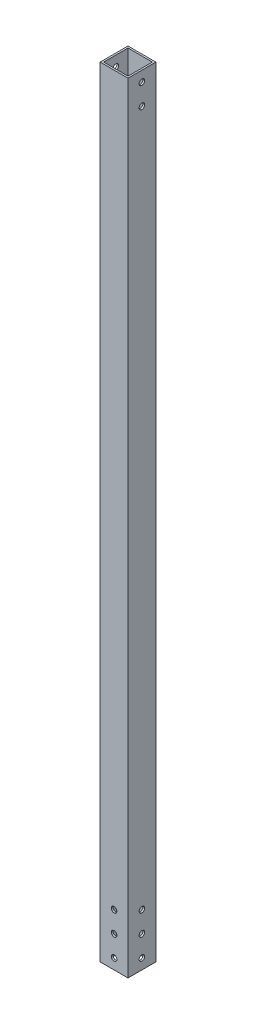
ISO-10303-21;
HEADER;
FILE_DESCRIPTION(('STEP AP214'),'2;1');
FILE_NAME('part.step','',(''),(''),'','','');
FILE_SCHEMA(('AUTOMOTIVE_DESIGN { 1 0 10303 214 1 1 1 1 }'));
ENDSEC;
DATA;
#1=APPLICATION_CONTEXT('core data for automotive mechanical design processes');
#2=APPLICATION_PROTOCOL_DEFINITION('international standard','automotive_design',2000,#1);
#3=PRODUCT_CONTEXT('',#1,'mechanical');
#4=PRODUCT('Part','Part','',(#3));
#5=PRODUCT_RELATED_PRODUCT_CATEGORY('part','',(#4));
#6=PRODUCT_DEFINITION_FORMATION('','',#4);
#7=PRODUCT_DEFINITION_CONTEXT('part definition',#1,'design');
#8=PRODUCT_DEFINITION('design','',#6,#7);
#9=PRODUCT_DEFINITION_SHAPE('','',#8);
#10=(LENGTH_UNIT() NAMED_UNIT(*) SI_UNIT(.MILLI.,.METRE.));
#11=(NAMED_UNIT(*) PLANE_ANGLE_UNIT() SI_UNIT($,.RADIAN.));
#12=(NAMED_UNIT(*) SI_UNIT($,.STERADIAN.) SOLID_ANGLE_UNIT());
#13=UNCERTAINTY_MEASURE_WITH_UNIT(LENGTH_MEASURE(1.E-05),#10,'distance_accuracy_value','');
#14=(GEOMETRIC_REPRESENTATION_CONTEXT(3) GLOBAL_UNCERTAINTY_ASSIGNED_CONTEXT((#13)) GLOBAL_UNIT_ASSIGNED_CONTEXT((#10,
#11,#12)) REPRESENTATION_CONTEXT('',''));
#15=CARTESIAN_POINT('',(0.,0.,0.));
#16=DIRECTION('',(0.,0.,1.));
#17=DIRECTION('',(1.,0.,0.));
#18=AXIS2_PLACEMENT_3D('',#15,#16,#17);
#19=CARTESIAN_POINT('',(0.,711.2,0.));
#20=DIRECTION('',(0.,1.,0.));
#21=DIRECTION('',(0.,0.,1.));
#22=AXIS2_PLACEMENT_3D('',#19,#20,#21);
#23=PLANE('',#22);
#24=DIRECTION('',(0.,0.,1.));
#25=VECTOR('',#24,1.);
#26=CARTESIAN_POINT('',(-12.7,711.2,12.7));
#27=LINE('',#26,#25);
#28=CARTESIAN_POINT('',(-12.7,711.2,-12.7));
#29=VERTEX_POINT('',#28);
#30=CARTESIAN_POINT('',(-12.7,711.2,12.7));
#31=VERTEX_POINT('',#30);
#32=EDGE_CURVE('E149',#29,#31,#27,.T.);
#33=ORIENTED_EDGE('',*,*,#32,.T.);
#34=DIRECTION('',(1.,0.,0.));
#35=VECTOR('',#34,1.);
#36=CARTESIAN_POINT('',(12.7,711.2,12.7));
#37=LINE('',#36,#35);
#38=CARTESIAN_POINT('',(12.7,711.2,12.7));
#39=VERTEX_POINT('',#38);
#40=EDGE_CURVE('E152',#31,#39,#37,.T.);
#41=ORIENTED_EDGE('',*,*,#40,.T.);
#42=DIRECTION('',(0.,0.,-1.));
#43=VECTOR('',#42,1.);
#44=CARTESIAN_POINT('',(12.7,711.2,12.7));
#45=LINE('',#44,#43);
#46=CARTESIAN_POINT('',(12.7,711.2,-12.7));
#47=VERTEX_POINT('',#46);
#48=EDGE_CURVE('E155',#39,#47,#45,.T.);
#49=ORIENTED_EDGE('',*,*,#48,.T.);
#50=DIRECTION('',(-1.,0.,0.));
#51=VECTOR('',#50,1.);
#52=CARTESIAN_POINT('',(12.7,711.2,-12.7));
#53=LINE('',#52,#51);
#54=EDGE_CURVE('E157',#47,#29,#53,.T.);
#55=ORIENTED_EDGE('',*,*,#54,.T.);
#56=EDGE_LOOP('',(#33,#41,#49,#55));
#57=FACE_BOUND('',#56,.T.);
#58=DIRECTION('',(-1.,0.,0.));
#59=VECTOR('',#58,1.);
#60=CARTESIAN_POINT('',(11.1125,711.2,-11.1125));
#61=LINE('',#60,#59);
#62=CARTESIAN_POINT('',(11.1125,711.2,-11.1125));
#63=VERTEX_POINT('',#62);
#64=CARTESIAN_POINT('',(-11.1125,711.2,-11.1125));
#65=VERTEX_POINT('',#64);
#66=EDGE_CURVE('E115',#63,#65,#61,.T.);
#67=ORIENTED_EDGE('',*,*,#66,.F.);
#68=DIRECTION('',(0.,0.,-1.));
#69=VECTOR('',#68,1.);
#70=CARTESIAN_POINT('',(11.1125,711.2,11.1125));
#71=LINE('',#70,#69);
#72=CARTESIAN_POINT('',(11.1125,711.2,11.1125));
#73=VERTEX_POINT('',#72);
#74=EDGE_CURVE('E107',#73,#63,#71,.T.);
#75=ORIENTED_EDGE('',*,*,#74,.F.);
#76=DIRECTION('',(1.,0.,0.));
#77=VECTOR('',#76,1.);
#78=CARTESIAN_POINT('',(11.1125,711.2,11.1125));
#79=LINE('',#78,#77);
#80=CARTESIAN_POINT('',(-11.1125,711.2,11.1125));
#81=VERTEX_POINT('',#80);
#82=EDGE_CURVE('E130',#81,#73,#79,.T.);
#83=ORIENTED_EDGE('',*,*,#82,.F.);
#84=DIRECTION('',(0.,0.,1.));
#85=VECTOR('',#84,1.);
#86=CARTESIAN_POINT('',(-11.1125,711.2,11.1125));
#87=LINE('',#86,#85);
#88=EDGE_CURVE('E128',#65,#81,#87,.T.);
#89=ORIENTED_EDGE('',*,*,#88,.F.);
#90=EDGE_LOOP('',(#67,#75,#83,#89));
#91=FACE_BOUND('',#90,.T.);
#92=ADVANCED_FACE('F39',(#57,#91),#23,.T.);
#93=CARTESIAN_POINT('',(0.,0.,0.));
#94=DIRECTION('',(0.,1.,0.));
#95=DIRECTION('',(0.,0.,1.));
#96=AXIS2_PLACEMENT_3D('',#93,#94,#95);
#97=PLANE('',#96);
#98=DIRECTION('',(0.,0.,1.));
#99=VECTOR('',#98,1.);
#100=CARTESIAN_POINT('',(-12.7,0.,12.7));
#101=LINE('',#100,#99);
#102=CARTESIAN_POINT('',(-12.7,0.,-12.7));
#103=VERTEX_POINT('',#102);
#104=CARTESIAN_POINT('',(-12.7,0.,12.7));
#105=VERTEX_POINT('',#104);
#106=EDGE_CURVE('E124',#103,#105,#101,.T.);
#107=ORIENTED_EDGE('',*,*,#106,.F.);
#108=DIRECTION('',(-1.,0.,0.));
#109=VECTOR('',#108,1.);
#110=CARTESIAN_POINT('',(12.7,0.,-12.7));
#111=LINE('',#110,#109);
#112=CARTESIAN_POINT('',(12.7,0.,-12.7));
#113=VERTEX_POINT('',#112);
#114=EDGE_CURVE('E153',#113,#103,#111,.T.);
#115=ORIENTED_EDGE('',*,*,#114,.F.);
#116=DIRECTION('',(0.,0.,-1.));
#117=VECTOR('',#116,1.);
#118=CARTESIAN_POINT('',(12.7,0.,12.7));
#119=LINE('',#118,#117);
#120=CARTESIAN_POINT('',(12.7,0.,12.7));
#121=VERTEX_POINT('',#120);
#122=EDGE_CURVE('E164',#121,#113,#119,.T.);
#123=ORIENTED_EDGE('',*,*,#122,.F.);
#124=DIRECTION('',(1.,0.,0.));
#125=VECTOR('',#124,1.);
#126=CARTESIAN_POINT('',(12.7,0.,12.7));
#127=LINE('',#126,#125);
#128=EDGE_CURVE('E162',#105,#121,#127,.T.);
#129=ORIENTED_EDGE('',*,*,#128,.F.);
#130=EDGE_LOOP('',(#107,#115,#123,#129));
#131=FACE_BOUND('',#130,.T.);
#132=DIRECTION('',(0.,0.,-1.));
#133=VECTOR('',#132,1.);
#134=CARTESIAN_POINT('',(11.1125,0.,11.1125));
#135=LINE('',#134,#133);
#136=CARTESIAN_POINT('',(11.1125,0.,11.1125));
#137=VERTEX_POINT('',#136);
#138=CARTESIAN_POINT('',(11.1125,0.,-11.1125));
#139=VERTEX_POINT('',#138);
#140=EDGE_CURVE('E65',#137,#139,#135,.T.);
#141=ORIENTED_EDGE('',*,*,#140,.T.);
#142=DIRECTION('',(-1.,0.,0.));
#143=VECTOR('',#142,1.);
#144=CARTESIAN_POINT('',(11.1125,0.,-11.1125));
#145=LINE('',#144,#143);
#146=CARTESIAN_POINT('',(-11.1125,0.,-11.1125));
#147=VERTEX_POINT('',#146);
#148=EDGE_CURVE('E122',#139,#147,#145,.T.);
#149=ORIENTED_EDGE('',*,*,#148,.T.);
#150=DIRECTION('',(0.,0.,1.));
#151=VECTOR('',#150,1.);
#152=CARTESIAN_POINT('',(-11.1125,0.,11.1125));
#153=LINE('',#152,#151);
#154=CARTESIAN_POINT('',(-11.1125,0.,11.1125));
#155=VERTEX_POINT('',#154);
#156=EDGE_CURVE('E138',#147,#155,#153,.T.);
#157=ORIENTED_EDGE('',*,*,#156,.T.);
#158=DIRECTION('',(1.,0.,0.));
#159=VECTOR('',#158,1.);
#160=CARTESIAN_POINT('',(11.1125,0.,11.1125));
#161=LINE('',#160,#159);
#162=EDGE_CURVE('E116',#155,#137,#161,.T.);
#163=ORIENTED_EDGE('',*,*,#162,.T.);
#164=EDGE_LOOP('',(#141,#149,#157,#163));
#165=FACE_BOUND('',#164,.T.);
#166=ADVANCED_FACE('F277',(#131,#165),#97,.F.);
#167=CARTESIAN_POINT('',(-12.7,711.2,12.7));
#168=DIRECTION('',(1.,0.,0.));
#169=DIRECTION('',(0.,0.,-1.));
#170=AXIS2_PLACEMENT_3D('',#167,#168,#169);
#171=PLANE('',#170);
#172=CARTESIAN_POINT('',(-12.7,9.525,0.));
#173=DIRECTION('',(1.,0.,0.));
#174=DIRECTION('',(0.,0.,-1.));
#175=AXIS2_PLACEMENT_3D('',#172,#173,#174);
#176=CIRCLE('',#175,2.5527);
#177=CARTESIAN_POINT('',(-12.7,9.525,-2.5527));
#178=VERTEX_POINT('',#177);
#179=EDGE_CURVE('E193',#178,#178,#176,.T.);
#180=ORIENTED_EDGE('',*,*,#179,.T.);
#181=EDGE_LOOP('',(#180));
#182=FACE_BOUND('',#181,.T.);
#183=CARTESIAN_POINT('',(-12.7,28.575,0.));
#184=DIRECTION('',(1.,0.,0.));
#185=DIRECTION('',(0.,0.,-1.));
#186=AXIS2_PLACEMENT_3D('',#183,#184,#185);
#187=CIRCLE('',#186,2.5527);
#188=CARTESIAN_POINT('',(-12.7,28.575,-2.5527));
#189=VERTEX_POINT('',#188);
#190=EDGE_CURVE('E359',#189,#189,#187,.T.);
#191=ORIENTED_EDGE('',*,*,#190,.T.);
#192=EDGE_LOOP('',(#191));
#193=FACE_BOUND('',#192,.T.);
#194=CARTESIAN_POINT('',(-12.7,47.625,0.));
#195=DIRECTION('',(1.,0.,0.));
#196=DIRECTION('',(0.,0.,-1.));
#197=AXIS2_PLACEMENT_3D('',#194,#195,#196);
#198=CIRCLE('',#197,2.5527);
#199=CARTESIAN_POINT('',(-12.7,47.625,-2.5527));
#200=VERTEX_POINT('',#199);
#201=EDGE_CURVE('E369',#200,#200,#198,.T.);
#202=ORIENTED_EDGE('',*,*,#201,.T.);
#203=EDGE_LOOP('',(#202));
#204=FACE_BOUND('',#203,.T.);
#205=CARTESIAN_POINT('',(-12.7,701.675,0.));
#206=DIRECTION('',(1.,0.,0.));
#207=DIRECTION('',(0.,0.,-1.));
#208=AXIS2_PLACEMENT_3D('',#205,#206,#207);
#209=CIRCLE('',#208,2.55270000000006);
#210=CARTESIAN_POINT('',(-12.7,701.675,-2.55270000000006));
#211=VERTEX_POINT('',#210);
#212=EDGE_CURVE('E375',#211,#211,#209,.T.);
#213=ORIENTED_EDGE('',*,*,#212,.T.);
#214=EDGE_LOOP('',(#213));
#215=FACE_BOUND('',#214,.T.);
#216=CARTESIAN_POINT('',(-12.7,682.625,0.));
#217=DIRECTION('',(1.,0.,0.));
#218=DIRECTION('',(0.,0.,-1.));
#219=AXIS2_PLACEMENT_3D('',#216,#217,#218);
#220=CIRCLE('',#219,2.55270000000006);
#221=CARTESIAN_POINT('',(-12.7,682.625,-2.55270000000006));
#222=VERTEX_POINT('',#221);
#223=EDGE_CURVE('E381',#222,#222,#220,.T.);
#224=ORIENTED_EDGE('',*,*,#223,.T.);
#225=EDGE_LOOP('',(#224));
#226=FACE_BOUND('',#225,.T.);
#227=ORIENTED_EDGE('',*,*,#106,.T.);
#228=DIRECTION('',(0.,-1.,0.));
#229=VECTOR('',#228,1.);
#230=CARTESIAN_POINT('',(-12.7,711.2,12.7));
#231=LINE('',#230,#229);
#232=EDGE_CURVE('E11',#31,#105,#231,.T.);
#233=ORIENTED_EDGE('',*,*,#232,.F.);
#234=ORIENTED_EDGE('',*,*,#32,.F.);
#235=DIRECTION('',(0.,-1.,0.));
#236=VECTOR('',#235,1.);
#237=CARTESIAN_POINT('',(-12.7,711.2,-12.7));
#238=LINE('',#237,#236);
#239=EDGE_CURVE('E159',#29,#103,#238,.T.);
#240=ORIENTED_EDGE('',*,*,#239,.T.);
#241=EDGE_LOOP('',(#227,#233,#234,#240));
#242=FACE_BOUND('',#241,.T.);
#243=ADVANCED_FACE('F41',(#182,#193,#204,#215,#226,#242),#171,.F.);
#244=CARTESIAN_POINT('',(12.7,711.2,12.7));
#245=DIRECTION('',(0.,0.,-1.));
#246=DIRECTION('',(-1.,0.,0.));
#247=AXIS2_PLACEMENT_3D('',#244,#245,#246);
#248=PLANE('',#247);
#249=CARTESIAN_POINT('',(0.,9.525,12.7));
#250=DIRECTION('',(0.,0.,1.));
#251=DIRECTION('',(1.,0.,0.));
#252=AXIS2_PLACEMENT_3D('',#249,#250,#251);
#253=CIRCLE('',#252,2.5527);
#254=CARTESIAN_POINT('',(2.5527,9.525,12.7));
#255=VERTEX_POINT('',#254);
#256=EDGE_CURVE('E221',#255,#255,#253,.T.);
#257=ORIENTED_EDGE('',*,*,#256,.F.);
#258=EDGE_LOOP('',(#257));
#259=FACE_BOUND('',#258,.T.);
#260=CARTESIAN_POINT('',(0.,28.575,12.7));
#261=DIRECTION('',(0.,0.,1.));
#262=DIRECTION('',(1.,0.,0.));
#263=AXIS2_PLACEMENT_3D('',#260,#261,#262);
#264=CIRCLE('',#263,2.5527);
#265=CARTESIAN_POINT('',(2.5527,28.575,12.7));
#266=VERTEX_POINT('',#265);
#267=EDGE_CURVE('E227',#266,#266,#264,.T.);
#268=ORIENTED_EDGE('',*,*,#267,.F.);
#269=EDGE_LOOP('',(#268));
#270=FACE_BOUND('',#269,.T.);
#271=CARTESIAN_POINT('',(0.,47.625,12.7));
#272=DIRECTION('',(0.,0.,1.));
#273=DIRECTION('',(1.,0.,0.));
#274=AXIS2_PLACEMENT_3D('',#271,#272,#273);
#275=CIRCLE('',#274,2.5527);
#276=CARTESIAN_POINT('',(2.5527,47.625,12.7));
#277=VERTEX_POINT('',#276);
#278=EDGE_CURVE('E218',#277,#277,#275,.T.);
#279=ORIENTED_EDGE('',*,*,#278,.F.);
#280=EDGE_LOOP('',(#279));
#281=FACE_BOUND('',#280,.T.);
#282=ORIENTED_EDGE('',*,*,#128,.T.);
#283=DIRECTION('',(0.,-1.,0.));
#284=VECTOR('',#283,1.);
#285=CARTESIAN_POINT('',(12.7,711.2,12.7));
#286=LINE('',#285,#284);
#287=EDGE_CURVE('E49',#39,#121,#286,.T.);
#288=ORIENTED_EDGE('',*,*,#287,.F.);
#289=ORIENTED_EDGE('',*,*,#40,.F.);
#290=ORIENTED_EDGE('',*,*,#232,.T.);
#291=EDGE_LOOP('',(#282,#288,#289,#290));
#292=FACE_BOUND('',#291,.T.);
#293=ADVANCED_FACE('F281',(#259,#270,#281,#292),#248,.F.);
#294=CARTESIAN_POINT('',(12.7,711.2,12.7));
#295=DIRECTION('',(-1.,0.,0.));
#296=DIRECTION('',(0.,0.,1.));
#297=AXIS2_PLACEMENT_3D('',#294,#295,#296);
#298=PLANE('',#297);
#299=CARTESIAN_POINT('',(12.7,9.525,0.));
#300=DIRECTION('',(1.,0.,0.));
#301=DIRECTION('',(0.,0.,-1.));
#302=AXIS2_PLACEMENT_3D('',#299,#300,#301);
#303=CIRCLE('',#302,2.5527);
#304=CARTESIAN_POINT('',(12.7,9.525,-2.5527));
#305=VERTEX_POINT('',#304);
#306=EDGE_CURVE('E358',#305,#305,#303,.T.);
#307=ORIENTED_EDGE('',*,*,#306,.F.);
#308=EDGE_LOOP('',(#307));
#309=FACE_BOUND('',#308,.T.);
#310=CARTESIAN_POINT('',(12.7,28.575,0.));
#311=DIRECTION('',(1.,0.,0.));
#312=DIRECTION('',(0.,0.,-1.));
#313=AXIS2_PLACEMENT_3D('',#310,#311,#312);
#314=CIRCLE('',#313,2.5527);
#315=CARTESIAN_POINT('',(12.7,28.575,-2.5527));
#316=VERTEX_POINT('',#315);
#317=EDGE_CURVE('E364',#316,#316,#314,.T.);
#318=ORIENTED_EDGE('',*,*,#317,.F.);
#319=EDGE_LOOP('',(#318));
#320=FACE_BOUND('',#319,.T.);
#321=CARTESIAN_POINT('',(12.7,47.625,0.));
#322=DIRECTION('',(1.,0.,0.));
#323=DIRECTION('',(0.,0.,-1.));
#324=AXIS2_PLACEMENT_3D('',#321,#322,#323);
#325=CIRCLE('',#324,2.5527);
#326=CARTESIAN_POINT('',(12.7,47.625,-2.5527));
#327=VERTEX_POINT('',#326);
#328=EDGE_CURVE('E372',#327,#327,#325,.T.);
#329=ORIENTED_EDGE('',*,*,#328,.F.);
#330=EDGE_LOOP('',(#329));
#331=FACE_BOUND('',#330,.T.);
#332=CARTESIAN_POINT('',(12.7,701.675,0.));
#333=DIRECTION('',(1.,0.,0.));
#334=DIRECTION('',(0.,0.,-1.));
#335=AXIS2_PLACEMENT_3D('',#332,#333,#334);
#336=CIRCLE('',#335,2.55270000000006);
#337=CARTESIAN_POINT('',(12.7,701.675,-2.55270000000006));
#338=VERTEX_POINT('',#337);
#339=EDGE_CURVE('E378',#338,#338,#336,.T.);
#340=ORIENTED_EDGE('',*,*,#339,.F.);
#341=EDGE_LOOP('',(#340));
#342=FACE_BOUND('',#341,.T.);
#343=CARTESIAN_POINT('',(12.7,682.625,0.));
#344=DIRECTION('',(1.,0.,0.));
#345=DIRECTION('',(0.,0.,-1.));
#346=AXIS2_PLACEMENT_3D('',#343,#344,#345);
#347=CIRCLE('',#346,2.55270000000006);
#348=CARTESIAN_POINT('',(12.7,682.625,-2.55270000000006));
#349=VERTEX_POINT('',#348);
#350=EDGE_CURVE('E384',#349,#349,#347,.T.);
#351=ORIENTED_EDGE('',*,*,#350,.F.);
#352=EDGE_LOOP('',(#351));
#353=FACE_BOUND('',#352,.T.);
#354=ORIENTED_EDGE('',*,*,#122,.T.);
#355=DIRECTION('',(0.,-1.,0.));
#356=VECTOR('',#355,1.);
#357=CARTESIAN_POINT('',(12.7,711.2,-12.7));
#358=LINE('',#357,#356);
#359=EDGE_CURVE('E170',#47,#113,#358,.T.);
#360=ORIENTED_EDGE('',*,*,#359,.F.);
#361=ORIENTED_EDGE('',*,*,#48,.F.);
#362=ORIENTED_EDGE('',*,*,#287,.T.);
#363=EDGE_LOOP('',(#354,#360,#361,#362));
#364=FACE_BOUND('',#363,.T.);
#365=ADVANCED_FACE('F264',(#309,#320,#331,#342,#353,#364),#298,.F.);
#366=CARTESIAN_POINT('',(12.7,711.2,-12.7));
#367=DIRECTION('',(0.,0.,1.));
#368=DIRECTION('',(1.,0.,0.));
#369=AXIS2_PLACEMENT_3D('',#366,#367,#368);
#370=PLANE('',#369);
#371=CARTESIAN_POINT('',(0.,9.525,-12.7));
#372=DIRECTION('',(0.,0.,1.));
#373=DIRECTION('',(1.,0.,0.));
#374=AXIS2_PLACEMENT_3D('',#371,#372,#373);
#375=CIRCLE('',#374,2.5527);
#376=CARTESIAN_POINT('',(2.5527,9.525,-12.7));
#377=VERTEX_POINT('',#376);
#378=EDGE_CURVE('E181',#377,#377,#375,.T.);
#379=ORIENTED_EDGE('',*,*,#378,.T.);
#380=EDGE_LOOP('',(#379));
#381=FACE_BOUND('',#380,.T.);
#382=CARTESIAN_POINT('',(0.,28.575,-12.7));
#383=DIRECTION('',(0.,0.,1.));
#384=DIRECTION('',(1.,0.,0.));
#385=AXIS2_PLACEMENT_3D('',#382,#383,#384);
#386=CIRCLE('',#385,2.5527);
#387=CARTESIAN_POINT('',(2.5527,28.575,-12.7));
#388=VERTEX_POINT('',#387);
#389=EDGE_CURVE('E224',#388,#388,#386,.T.);
#390=ORIENTED_EDGE('',*,*,#389,.T.);
#391=EDGE_LOOP('',(#390));
#392=FACE_BOUND('',#391,.T.);
#393=CARTESIAN_POINT('',(0.,47.625,-12.7));
#394=DIRECTION('',(0.,0.,1.));
#395=DIRECTION('',(1.,0.,0.));
#396=AXIS2_PLACEMENT_3D('',#393,#394,#395);
#397=CIRCLE('',#396,2.5527);
#398=CARTESIAN_POINT('',(2.5527,47.625,-12.7));
#399=VERTEX_POINT('',#398);
#400=EDGE_CURVE('E230',#399,#399,#397,.T.);
#401=ORIENTED_EDGE('',*,*,#400,.T.);
#402=EDGE_LOOP('',(#401));
#403=FACE_BOUND('',#402,.T.);
#404=ORIENTED_EDGE('',*,*,#114,.T.);
#405=ORIENTED_EDGE('',*,*,#239,.F.);
#406=ORIENTED_EDGE('',*,*,#54,.F.);
#407=ORIENTED_EDGE('',*,*,#359,.T.);
#408=EDGE_LOOP('',(#404,#405,#406,#407));
#409=FACE_BOUND('',#408,.T.);
#410=ADVANCED_FACE('F261',(#381,#392,#403,#409),#370,.F.);
#411=CARTESIAN_POINT('',(11.1125,711.2,11.1125));
#412=DIRECTION('',(-1.,0.,0.));
#413=DIRECTION('',(0.,0.,1.));
#414=AXIS2_PLACEMENT_3D('',#411,#412,#413);
#415=PLANE('',#414);
#416=CARTESIAN_POINT('',(11.1125,9.525,0.));
#417=DIRECTION('',(-1.,0.,0.));
#418=DIRECTION('',(0.,0.,1.));
#419=AXIS2_PLACEMENT_3D('',#416,#417,#418);
#420=CIRCLE('',#419,2.5527);
#421=CARTESIAN_POINT('',(11.1125,9.525,2.5527));
#422=VERTEX_POINT('',#421);
#423=EDGE_CURVE('E215',#422,#422,#420,.T.);
#424=ORIENTED_EDGE('',*,*,#423,.F.);
#425=EDGE_LOOP('',(#424));
#426=FACE_BOUND('',#425,.T.);
#427=CARTESIAN_POINT('',(11.1125,28.575,0.));
#428=DIRECTION('',(-1.,0.,0.));
#429=DIRECTION('',(0.,0.,1.));
#430=AXIS2_PLACEMENT_3D('',#427,#428,#429);
#431=CIRCLE('',#430,2.5527);
#432=CARTESIAN_POINT('',(11.1125,28.575,2.5527));
#433=VERTEX_POINT('',#432);
#434=EDGE_CURVE('E203',#433,#433,#431,.T.);
#435=ORIENTED_EDGE('',*,*,#434,.F.);
#436=EDGE_LOOP('',(#435));
#437=FACE_BOUND('',#436,.T.);
#438=CARTESIAN_POINT('',(11.1125,47.625,0.));
#439=DIRECTION('',(-1.,0.,0.));
#440=DIRECTION('',(0.,0.,1.));
#441=AXIS2_PLACEMENT_3D('',#438,#439,#440);
#442=CIRCLE('',#441,2.5527);
#443=CARTESIAN_POINT('',(11.1125,47.625,2.5527));
#444=VERTEX_POINT('',#443);
#445=EDGE_CURVE('E200',#444,#444,#442,.T.);
#446=ORIENTED_EDGE('',*,*,#445,.F.);
#447=EDGE_LOOP('',(#446));
#448=FACE_BOUND('',#447,.T.);
#449=CARTESIAN_POINT('',(11.1125,701.675,0.));
#450=DIRECTION('',(-1.,0.,0.));
#451=DIRECTION('',(0.,0.,1.));
#452=AXIS2_PLACEMENT_3D('',#449,#450,#451);
#453=CIRCLE('',#452,2.55270000000006);
#454=CARTESIAN_POINT('',(11.1125,701.675,2.55270000000006));
#455=VERTEX_POINT('',#454);
#456=EDGE_CURVE('E197',#455,#455,#453,.T.);
#457=ORIENTED_EDGE('',*,*,#456,.F.);
#458=EDGE_LOOP('',(#457));
#459=FACE_BOUND('',#458,.T.);
#460=CARTESIAN_POINT('',(11.1125,682.625,0.));
#461=DIRECTION('',(-1.,0.,0.));
#462=DIRECTION('',(0.,0.,1.));
#463=AXIS2_PLACEMENT_3D('',#460,#461,#462);
#464=CIRCLE('',#463,2.55270000000006);
#465=CARTESIAN_POINT('',(11.1125,682.625,2.55270000000006));
#466=VERTEX_POINT('',#465);
#467=EDGE_CURVE('E192',#466,#466,#464,.T.);
#468=ORIENTED_EDGE('',*,*,#467,.F.);
#469=EDGE_LOOP('',(#468));
#470=FACE_BOUND('',#469,.T.);
#471=ORIENTED_EDGE('',*,*,#140,.F.);
#472=DIRECTION('',(0.,-1.,0.));
#473=VECTOR('',#472,1.);
#474=CARTESIAN_POINT('',(11.1125,711.2,11.1125));
#475=LINE('',#474,#473);
#476=EDGE_CURVE('E111',#73,#137,#475,.T.);
#477=ORIENTED_EDGE('',*,*,#476,.F.);
#478=ORIENTED_EDGE('',*,*,#74,.T.);
#479=DIRECTION('',(0.,-1.,0.));
#480=VECTOR('',#479,1.);
#481=CARTESIAN_POINT('',(11.1125,711.2,-11.1125));
#482=LINE('',#481,#480);
#483=EDGE_CURVE('E110',#63,#139,#482,.T.);
#484=ORIENTED_EDGE('',*,*,#483,.T.);
#485=EDGE_LOOP('',(#471,#477,#478,#484));
#486=FACE_BOUND('',#485,.T.);
#487=ADVANCED_FACE('F109',(#426,#437,#448,#459,#470,#486),#415,.T.);
#488=CARTESIAN_POINT('',(11.1125,711.2,-11.1125));
#489=DIRECTION('',(0.,0.,1.));
#490=DIRECTION('',(1.,0.,0.));
#491=AXIS2_PLACEMENT_3D('',#488,#489,#490);
#492=PLANE('',#491);
#493=CARTESIAN_POINT('',(0.,9.525,-11.1125));
#494=DIRECTION('',(0.,0.,1.));
#495=DIRECTION('',(1.,0.,0.));
#496=AXIS2_PLACEMENT_3D('',#493,#494,#495);
#497=CIRCLE('',#496,2.5527);
#498=CARTESIAN_POINT('',(2.5527,9.525,-11.1125));
#499=VERTEX_POINT('',#498);
#500=EDGE_CURVE('E136',#499,#499,#497,.T.);
#501=ORIENTED_EDGE('',*,*,#500,.F.);
#502=EDGE_LOOP('',(#501));
#503=FACE_BOUND('',#502,.T.);
#504=CARTESIAN_POINT('',(0.,28.575,-11.1125));
#505=DIRECTION('',(0.,0.,1.));
#506=DIRECTION('',(1.,0.,0.));
#507=AXIS2_PLACEMENT_3D('',#504,#505,#506);
#508=CIRCLE('',#507,2.5527);
#509=CARTESIAN_POINT('',(2.5527,28.575,-11.1125));
#510=VERTEX_POINT('',#509);
#511=EDGE_CURVE('E185',#510,#510,#508,.T.);
#512=ORIENTED_EDGE('',*,*,#511,.F.);
#513=EDGE_LOOP('',(#512));
#514=FACE_BOUND('',#513,.T.);
#515=CARTESIAN_POINT('',(0.,47.625,-11.1125));
#516=DIRECTION('',(0.,0.,1.));
#517=DIRECTION('',(1.,0.,0.));
#518=AXIS2_PLACEMENT_3D('',#515,#516,#517);
#519=CIRCLE('',#518,2.5527);
#520=CARTESIAN_POINT('',(2.5527,47.625,-11.1125));
#521=VERTEX_POINT('',#520);
#522=EDGE_CURVE('E180',#521,#521,#519,.T.);
#523=ORIENTED_EDGE('',*,*,#522,.F.);
#524=EDGE_LOOP('',(#523));
#525=FACE_BOUND('',#524,.T.);
#526=ORIENTED_EDGE('',*,*,#148,.F.);
#527=ORIENTED_EDGE('',*,*,#483,.F.);
#528=ORIENTED_EDGE('',*,*,#66,.T.);
#529=DIRECTION('',(0.,-1.,0.));
#530=VECTOR('',#529,1.);
#531=CARTESIAN_POINT('',(-11.1125,711.2,-11.1125));
#532=LINE('',#531,#530);
#533=EDGE_CURVE('E125',#65,#147,#532,.T.);
#534=ORIENTED_EDGE('',*,*,#533,.T.);
#535=EDGE_LOOP('',(#526,#527,#528,#534));
#536=FACE_BOUND('',#535,.T.);
#537=ADVANCED_FACE('F119',(#503,#514,#525,#536),#492,.T.);
#538=CARTESIAN_POINT('',(-11.1125,711.2,11.1125));
#539=DIRECTION('',(1.,0.,0.));
#540=DIRECTION('',(0.,0.,-1.));
#541=AXIS2_PLACEMENT_3D('',#538,#539,#540);
#542=PLANE('',#541);
#543=CARTESIAN_POINT('',(-11.1125,9.525,0.));
#544=DIRECTION('',(1.,0.,0.));
#545=DIRECTION('',(0.,0.,-1.));
#546=AXIS2_PLACEMENT_3D('',#543,#544,#545);
#547=CIRCLE('',#546,2.5527);
#548=CARTESIAN_POINT('',(-11.1125,9.525,-2.5527));
#549=VERTEX_POINT('',#548);
#550=EDGE_CURVE('E43',#549,#549,#547,.T.);
#551=ORIENTED_EDGE('',*,*,#550,.F.);
#552=EDGE_LOOP('',(#551));
#553=FACE_BOUND('',#552,.T.);
#554=CARTESIAN_POINT('',(-11.1125,28.575,0.));
#555=DIRECTION('',(1.,0.,0.));
#556=DIRECTION('',(0.,0.,-1.));
#557=AXIS2_PLACEMENT_3D('',#554,#555,#556);
#558=CIRCLE('',#557,2.5527);
#559=CARTESIAN_POINT('',(-11.1125,28.575,-2.5527));
#560=VERTEX_POINT('',#559);
#561=EDGE_CURVE('E201',#560,#560,#558,.T.);
#562=ORIENTED_EDGE('',*,*,#561,.F.);
#563=EDGE_LOOP('',(#562));
#564=FACE_BOUND('',#563,.T.);
#565=CARTESIAN_POINT('',(-11.1125,47.625,0.));
#566=DIRECTION('',(1.,0.,0.));
#567=DIRECTION('',(0.,0.,-1.));
#568=AXIS2_PLACEMENT_3D('',#565,#566,#567);
#569=CIRCLE('',#568,2.5527);
#570=CARTESIAN_POINT('',(-11.1125,47.625,-2.5527));
#571=VERTEX_POINT('',#570);
#572=EDGE_CURVE('E198',#571,#571,#569,.T.);
#573=ORIENTED_EDGE('',*,*,#572,.F.);
#574=EDGE_LOOP('',(#573));
#575=FACE_BOUND('',#574,.T.);
#576=CARTESIAN_POINT('',(-11.1125,701.675,0.));
#577=DIRECTION('',(1.,0.,0.));
#578=DIRECTION('',(0.,0.,-1.));
#579=AXIS2_PLACEMENT_3D('',#576,#577,#578);
#580=CIRCLE('',#579,2.55270000000006);
#581=CARTESIAN_POINT('',(-11.1125,701.675,-2.55270000000006));
#582=VERTEX_POINT('',#581);
#583=EDGE_CURVE('E194',#582,#582,#580,.T.);
#584=ORIENTED_EDGE('',*,*,#583,.F.);
#585=EDGE_LOOP('',(#584));
#586=FACE_BOUND('',#585,.T.);
#587=CARTESIAN_POINT('',(-11.1125,682.625,0.));
#588=DIRECTION('',(1.,0.,0.));
#589=DIRECTION('',(0.,0.,-1.));
#590=AXIS2_PLACEMENT_3D('',#587,#588,#589);
#591=CIRCLE('',#590,2.55270000000006);
#592=CARTESIAN_POINT('',(-11.1125,682.625,-2.55270000000006));
#593=VERTEX_POINT('',#592);
#594=EDGE_CURVE('E189',#593,#593,#591,.T.);
#595=ORIENTED_EDGE('',*,*,#594,.F.);
#596=EDGE_LOOP('',(#595));
#597=FACE_BOUND('',#596,.T.);
#598=ORIENTED_EDGE('',*,*,#156,.F.);
#599=ORIENTED_EDGE('',*,*,#533,.F.);
#600=ORIENTED_EDGE('',*,*,#88,.T.);
#601=DIRECTION('',(0.,-1.,0.));
#602=VECTOR('',#601,1.);
#603=CARTESIAN_POINT('',(-11.1125,711.2,11.1125));
#604=LINE('',#603,#602);
#605=EDGE_CURVE('E57',#81,#155,#604,.T.);
#606=ORIENTED_EDGE('',*,*,#605,.T.);
#607=EDGE_LOOP('',(#598,#599,#600,#606));
#608=FACE_BOUND('',#607,.T.);
#609=ADVANCED_FACE('F246',(#553,#564,#575,#586,#597,#608),#542,.T.);
#610=CARTESIAN_POINT('',(11.1125,711.2,11.1125));
#611=DIRECTION('',(0.,0.,-1.));
#612=DIRECTION('',(-1.,0.,0.));
#613=AXIS2_PLACEMENT_3D('',#610,#611,#612);
#614=PLANE('',#613);
#615=CARTESIAN_POINT('',(0.,9.525,11.1125));
#616=DIRECTION('',(0.,0.,-1.));
#617=DIRECTION('',(-1.,0.,0.));
#618=AXIS2_PLACEMENT_3D('',#615,#616,#617);
#619=CIRCLE('',#618,2.5527);
#620=CARTESIAN_POINT('',(-2.5527,9.525,11.1125));
#621=VERTEX_POINT('',#620);
#622=EDGE_CURVE('E186',#621,#621,#619,.T.);
#623=ORIENTED_EDGE('',*,*,#622,.F.);
#624=EDGE_LOOP('',(#623));
#625=FACE_BOUND('',#624,.T.);
#626=CARTESIAN_POINT('',(0.,28.575,11.1125));
#627=DIRECTION('',(0.,0.,-1.));
#628=DIRECTION('',(-1.,0.,0.));
#629=AXIS2_PLACEMENT_3D('',#626,#627,#628);
#630=CIRCLE('',#629,2.5527);
#631=CARTESIAN_POINT('',(-2.5527,28.575,11.1125));
#632=VERTEX_POINT('',#631);
#633=EDGE_CURVE('E182',#632,#632,#630,.T.);
#634=ORIENTED_EDGE('',*,*,#633,.F.);
#635=EDGE_LOOP('',(#634));
#636=FACE_BOUND('',#635,.T.);
#637=CARTESIAN_POINT('',(0.,47.625,11.1125));
#638=DIRECTION('',(0.,0.,-1.));
#639=DIRECTION('',(-1.,0.,0.));
#640=AXIS2_PLACEMENT_3D('',#637,#638,#639);
#641=CIRCLE('',#640,2.5527);
#642=CARTESIAN_POINT('',(-2.5527,47.625,11.1125));
#643=VERTEX_POINT('',#642);
#644=EDGE_CURVE('E177',#643,#643,#641,.T.);
#645=ORIENTED_EDGE('',*,*,#644,.F.);
#646=EDGE_LOOP('',(#645));
#647=FACE_BOUND('',#646,.T.);
#648=ORIENTED_EDGE('',*,*,#162,.F.);
#649=ORIENTED_EDGE('',*,*,#605,.F.);
#650=ORIENTED_EDGE('',*,*,#82,.T.);
#651=ORIENTED_EDGE('',*,*,#476,.T.);
#652=EDGE_LOOP('',(#648,#649,#650,#651));
#653=FACE_BOUND('',#652,.T.);
#654=ADVANCED_FACE('F306',(#625,#636,#647,#653),#614,.T.);
#655=CARTESIAN_POINT('',(0.,47.625,-12.7));
#656=DIRECTION('',(0.,0.,1.));
#657=DIRECTION('',(1.,0.,0.));
#658=AXIS2_PLACEMENT_3D('',#655,#656,#657);
#659=CYLINDRICAL_SURFACE('',#658,2.5527);
#660=ORIENTED_EDGE('',*,*,#644,.T.);
#661=EDGE_LOOP('',(#660));
#662=FACE_BOUND('',#661,.T.);
#663=ORIENTED_EDGE('',*,*,#278,.T.);
#664=EDGE_LOOP('',(#663));
#665=FACE_BOUND('',#664,.T.);
#666=ADVANCED_FACE('F258',(#662,#665),#659,.F.);
#667=CARTESIAN_POINT('',(0.,28.575,-12.7));
#668=DIRECTION('',(0.,0.,1.));
#669=DIRECTION('',(1.,0.,0.));
#670=AXIS2_PLACEMENT_3D('',#667,#668,#669);
#671=CYLINDRICAL_SURFACE('',#670,2.5527);
#672=ORIENTED_EDGE('',*,*,#633,.T.);
#673=EDGE_LOOP('',(#672));
#674=FACE_BOUND('',#673,.T.);
#675=ORIENTED_EDGE('',*,*,#267,.T.);
#676=EDGE_LOOP('',(#675));
#677=FACE_BOUND('',#676,.T.);
#678=ADVANCED_FACE('F312',(#674,#677),#671,.F.);
#679=CARTESIAN_POINT('',(0.,9.525,-12.7));
#680=DIRECTION('',(0.,0.,1.));
#681=DIRECTION('',(1.,0.,0.));
#682=AXIS2_PLACEMENT_3D('',#679,#680,#681);
#683=CYLINDRICAL_SURFACE('',#682,2.5527);
#684=ORIENTED_EDGE('',*,*,#622,.T.);
#685=EDGE_LOOP('',(#684));
#686=FACE_BOUND('',#685,.T.);
#687=ORIENTED_EDGE('',*,*,#256,.T.);
#688=EDGE_LOOP('',(#687));
#689=FACE_BOUND('',#688,.T.);
#690=ADVANCED_FACE('F256',(#686,#689),#683,.F.);
#691=ORIENTED_EDGE('',*,*,#522,.T.);
#692=EDGE_LOOP('',(#691));
#693=FACE_BOUND('',#692,.T.);
#694=ORIENTED_EDGE('',*,*,#400,.F.);
#695=EDGE_LOOP('',(#694));
#696=FACE_BOUND('',#695,.T.);
#697=ADVANCED_FACE('F252',(#693,#696),#659,.F.);
#698=ORIENTED_EDGE('',*,*,#511,.T.);
#699=EDGE_LOOP('',(#698));
#700=FACE_BOUND('',#699,.T.);
#701=ORIENTED_EDGE('',*,*,#389,.F.);
#702=EDGE_LOOP('',(#701));
#703=FACE_BOUND('',#702,.T.);
#704=ADVANCED_FACE('F255',(#700,#703),#671,.F.);
#705=ORIENTED_EDGE('',*,*,#500,.T.);
#706=EDGE_LOOP('',(#705));
#707=FACE_BOUND('',#706,.T.);
#708=ORIENTED_EDGE('',*,*,#378,.F.);
#709=EDGE_LOOP('',(#708));
#710=FACE_BOUND('',#709,.T.);
#711=ADVANCED_FACE('F241',(#707,#710),#683,.F.);
#712=CARTESIAN_POINT('',(-12.7,682.625,0.));
#713=DIRECTION('',(1.,0.,0.));
#714=DIRECTION('',(0.,0.,-1.));
#715=AXIS2_PLACEMENT_3D('',#712,#713,#714);
#716=CYLINDRICAL_SURFACE('',#715,2.55270000000006);
#717=ORIENTED_EDGE('',*,*,#594,.T.);
#718=EDGE_LOOP('',(#717));
#719=FACE_BOUND('',#718,.T.);
#720=ORIENTED_EDGE('',*,*,#223,.F.);
#721=EDGE_LOOP('',(#720));
#722=FACE_BOUND('',#721,.T.);
#723=ADVANCED_FACE('F320',(#719,#722),#716,.F.);
#724=CARTESIAN_POINT('',(-12.7,701.675,0.));
#725=DIRECTION('',(1.,0.,0.));
#726=DIRECTION('',(0.,0.,-1.));
#727=AXIS2_PLACEMENT_3D('',#724,#725,#726);
#728=CYLINDRICAL_SURFACE('',#727,2.55270000000006);
#729=ORIENTED_EDGE('',*,*,#583,.T.);
#730=EDGE_LOOP('',(#729));
#731=FACE_BOUND('',#730,.T.);
#732=ORIENTED_EDGE('',*,*,#212,.F.);
#733=EDGE_LOOP('',(#732));
#734=FACE_BOUND('',#733,.T.);
#735=ADVANCED_FACE('F323',(#731,#734),#728,.F.);
#736=CARTESIAN_POINT('',(-12.7,47.625,0.));
#737=DIRECTION('',(1.,0.,0.));
#738=DIRECTION('',(0.,0.,-1.));
#739=AXIS2_PLACEMENT_3D('',#736,#737,#738);
#740=CYLINDRICAL_SURFACE('',#739,2.5527);
#741=ORIENTED_EDGE('',*,*,#572,.T.);
#742=EDGE_LOOP('',(#741));
#743=FACE_BOUND('',#742,.T.);
#744=ORIENTED_EDGE('',*,*,#201,.F.);
#745=EDGE_LOOP('',(#744));
#746=FACE_BOUND('',#745,.T.);
#747=ADVANCED_FACE('F328',(#743,#746),#740,.F.);
#748=CARTESIAN_POINT('',(-12.7,28.575,0.));
#749=DIRECTION('',(1.,0.,0.));
#750=DIRECTION('',(0.,0.,-1.));
#751=AXIS2_PLACEMENT_3D('',#748,#749,#750);
#752=CYLINDRICAL_SURFACE('',#751,2.5527);
#753=ORIENTED_EDGE('',*,*,#561,.T.);
#754=EDGE_LOOP('',(#753));
#755=FACE_BOUND('',#754,.T.);
#756=ORIENTED_EDGE('',*,*,#190,.F.);
#757=EDGE_LOOP('',(#756));
#758=FACE_BOUND('',#757,.T.);
#759=ADVANCED_FACE('F333',(#755,#758),#752,.F.);
#760=CARTESIAN_POINT('',(-12.7,9.525,0.));
#761=DIRECTION('',(1.,0.,0.));
#762=DIRECTION('',(0.,0.,-1.));
#763=AXIS2_PLACEMENT_3D('',#760,#761,#762);
#764=CYLINDRICAL_SURFACE('',#763,2.5527);
#765=ORIENTED_EDGE('',*,*,#550,.T.);
#766=EDGE_LOOP('',(#765));
#767=FACE_BOUND('',#766,.T.);
#768=ORIENTED_EDGE('',*,*,#179,.F.);
#769=EDGE_LOOP('',(#768));
#770=FACE_BOUND('',#769,.T.);
#771=ADVANCED_FACE('F338',(#767,#770),#764,.F.);
#772=ORIENTED_EDGE('',*,*,#467,.T.);
#773=EDGE_LOOP('',(#772));
#774=FACE_BOUND('',#773,.T.);
#775=ORIENTED_EDGE('',*,*,#350,.T.);
#776=EDGE_LOOP('',(#775));
#777=FACE_BOUND('',#776,.T.);
#778=ADVANCED_FACE('F325',(#774,#777),#716,.F.);
#779=ORIENTED_EDGE('',*,*,#456,.T.);
#780=EDGE_LOOP('',(#779));
#781=FACE_BOUND('',#780,.T.);
#782=ORIENTED_EDGE('',*,*,#339,.T.);
#783=EDGE_LOOP('',(#782));
#784=FACE_BOUND('',#783,.T.);
#785=ADVANCED_FACE('F330',(#781,#784),#728,.F.);
#786=ORIENTED_EDGE('',*,*,#445,.T.);
#787=EDGE_LOOP('',(#786));
#788=FACE_BOUND('',#787,.T.);
#789=ORIENTED_EDGE('',*,*,#328,.T.);
#790=EDGE_LOOP('',(#789));
#791=FACE_BOUND('',#790,.T.);
#792=ADVANCED_FACE('F335',(#788,#791),#740,.F.);
#793=ORIENTED_EDGE('',*,*,#434,.T.);
#794=EDGE_LOOP('',(#793));
#795=FACE_BOUND('',#794,.T.);
#796=ORIENTED_EDGE('',*,*,#317,.T.);
#797=EDGE_LOOP('',(#796));
#798=FACE_BOUND('',#797,.T.);
#799=ADVANCED_FACE('F339',(#795,#798),#752,.F.);
#800=ORIENTED_EDGE('',*,*,#423,.T.);
#801=EDGE_LOOP('',(#800));
#802=FACE_BOUND('',#801,.T.);
#803=ORIENTED_EDGE('',*,*,#306,.T.);
#804=EDGE_LOOP('',(#803));
#805=FACE_BOUND('',#804,.T.);
#806=ADVANCED_FACE('F342',(#802,#805),#764,.F.);
#807=CLOSED_SHELL('',(#92,#166,#243,#293,#365,#410,#487,#537,#609,#654,#666,#678,#690,#697,#704,
#711,#723,#735,#747,#759,#771,#778,#785,#792,#799,#806));
#808=MANIFOLD_SOLID_BREP('B2',#807);
#809=ADVANCED_BREP_SHAPE_REPRESENTATION('',(#18,#808),#14);
#810=SHAPE_DEFINITION_REPRESENTATION(#9,#809);
ENDSEC;
END-ISO-10303-21;
